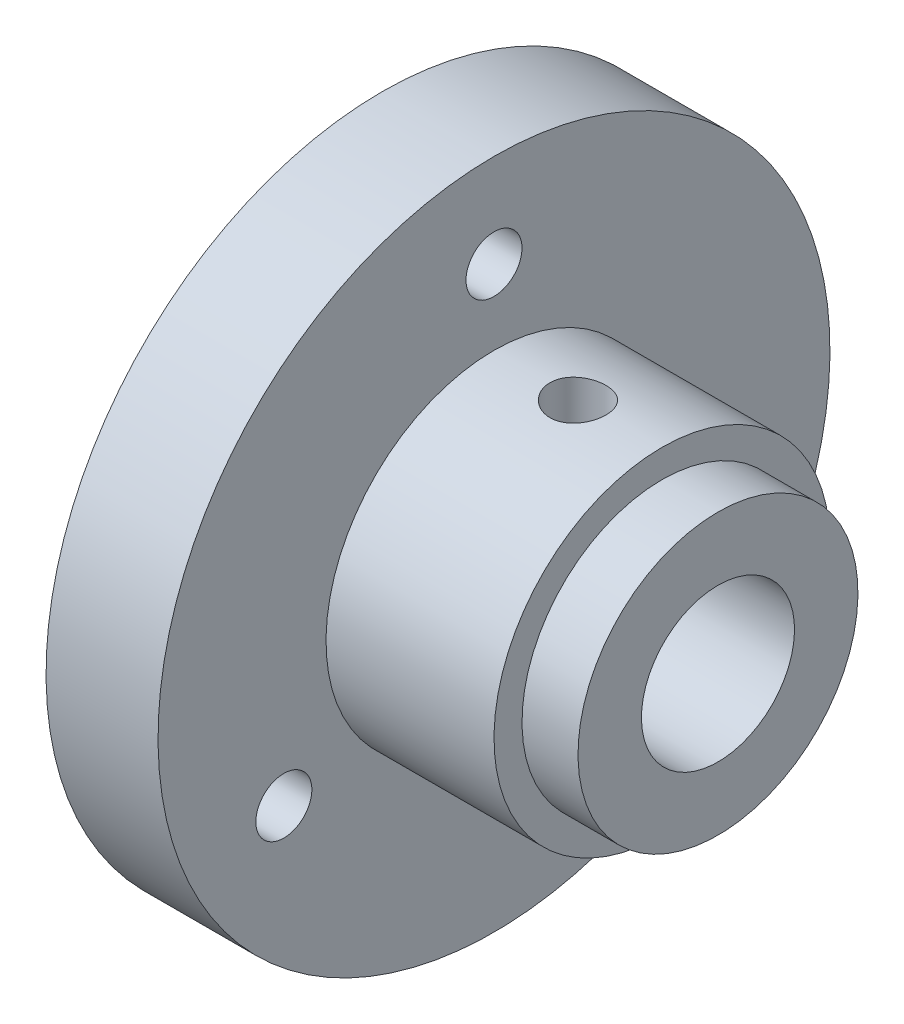
ISO-10303-21;
HEADER;
FILE_DESCRIPTION(('STEP AP214'),'2;1');
FILE_NAME('part.step','',(''),(''),'','','');
FILE_SCHEMA(('AUTOMOTIVE_DESIGN { 1 0 10303 214 1 1 1 1 }'));
ENDSEC;
DATA;
#1=APPLICATION_CONTEXT('core data for automotive mechanical design processes');
#2=APPLICATION_PROTOCOL_DEFINITION('international standard','automotive_design',2000,#1);
#3=PRODUCT_CONTEXT('',#1,'mechanical');
#4=PRODUCT('Part','Part','',(#3));
#5=PRODUCT_RELATED_PRODUCT_CATEGORY('part','',(#4));
#6=PRODUCT_DEFINITION_FORMATION('','',#4);
#7=PRODUCT_DEFINITION_CONTEXT('part definition',#1,'design');
#8=PRODUCT_DEFINITION('design','',#6,#7);
#9=PRODUCT_DEFINITION_SHAPE('','',#8);
#10=(LENGTH_UNIT() NAMED_UNIT(*) SI_UNIT(.MILLI.,.METRE.));
#11=(NAMED_UNIT(*) PLANE_ANGLE_UNIT() SI_UNIT($,.RADIAN.));
#12=(NAMED_UNIT(*) SI_UNIT($,.STERADIAN.) SOLID_ANGLE_UNIT());
#13=UNCERTAINTY_MEASURE_WITH_UNIT(LENGTH_MEASURE(1.E-05),#10,'distance_accuracy_value','');
#14=(GEOMETRIC_REPRESENTATION_CONTEXT(3) GLOBAL_UNCERTAINTY_ASSIGNED_CONTEXT((#13)) GLOBAL_UNIT_ASSIGNED_CONTEXT((#10,
#11,#12)) REPRESENTATION_CONTEXT('',''));
#15=CARTESIAN_POINT('',(0.,0.,0.));
#16=DIRECTION('',(0.,0.,1.));
#17=DIRECTION('',(1.,0.,0.));
#18=AXIS2_PLACEMENT_3D('',#15,#16,#17);
#19=CARTESIAN_POINT('',(-12.,18.,0.));
#20=DIRECTION('',(1.,0.,0.));
#21=DIRECTION('',(0.,1.,0.));
#22=AXIS2_PLACEMENT_3D('',#19,#20,#21);
#23=PLANE('',#22);
#24=CARTESIAN_POINT('',(-12.,13.,0.));
#25=DIRECTION('',(1.,0.,0.));
#26=DIRECTION('',(0.,1.,0.));
#27=AXIS2_PLACEMENT_3D('',#24,#25,#26);
#28=CIRCLE('',#27,1.5);
#29=CARTESIAN_POINT('',(-12.,14.5,0.));
#30=VERTEX_POINT('',#29);
#31=EDGE_CURVE('E80',#30,#30,#28,.T.);
#32=ORIENTED_EDGE('',*,*,#31,.F.);
#33=EDGE_LOOP('',(#32));
#34=FACE_BOUND('',#33,.T.);
#35=CARTESIAN_POINT('',(-12.,-6.5,-11.2583302491977));
#36=DIRECTION('',(1.,0.,0.));
#37=DIRECTION('',(0.,1.,0.));
#38=AXIS2_PLACEMENT_3D('',#35,#36,#37);
#39=CIRCLE('',#38,1.5);
#40=CARTESIAN_POINT('',(-12.,-5.,-11.2583302491977));
#41=VERTEX_POINT('',#40);
#42=EDGE_CURVE('E77',#41,#41,#39,.T.);
#43=ORIENTED_EDGE('',*,*,#42,.F.);
#44=EDGE_LOOP('',(#43));
#45=FACE_BOUND('',#44,.T.);
#46=CARTESIAN_POINT('',(-12.,-6.50000000000001,11.2583302491977));
#47=DIRECTION('',(1.,0.,0.));
#48=DIRECTION('',(0.,1.,0.));
#49=AXIS2_PLACEMENT_3D('',#46,#47,#48);
#50=CIRCLE('',#49,1.5);
#51=CARTESIAN_POINT('',(-12.,-5.00000000000001,11.2583302491977));
#52=VERTEX_POINT('',#51);
#53=EDGE_CURVE('E70',#52,#52,#50,.T.);
#54=ORIENTED_EDGE('',*,*,#53,.F.);
#55=EDGE_LOOP('',(#54));
#56=FACE_BOUND('',#55,.T.);
#57=CARTESIAN_POINT('',(-12.,0.,0.));
#58=DIRECTION('',(1.,0.,0.));
#59=DIRECTION('',(0.,1.,0.));
#60=AXIS2_PLACEMENT_3D('',#57,#58,#59);
#61=CIRCLE('',#60,18.);
#62=CARTESIAN_POINT('',(-12.,18.,0.));
#63=VERTEX_POINT('',#62);
#64=EDGE_CURVE('E63',#63,#63,#61,.T.);
#65=ORIENTED_EDGE('',*,*,#64,.T.);
#66=EDGE_LOOP('',(#65));
#67=FACE_BOUND('',#66,.T.);
#68=CARTESIAN_POINT('',(-12.,0.,0.));
#69=DIRECTION('',(1.,0.,0.));
#70=DIRECTION('',(0.,1.,0.));
#71=AXIS2_PLACEMENT_3D('',#68,#69,#70);
#72=CIRCLE('',#71,9.);
#73=CARTESIAN_POINT('',(-12.,9.,0.));
#74=VERTEX_POINT('',#73);
#75=EDGE_CURVE('E10',#74,#74,#72,.T.);
#76=ORIENTED_EDGE('',*,*,#75,.F.);
#77=EDGE_LOOP('',(#76));
#78=FACE_BOUND('',#77,.T.);
#79=ADVANCED_FACE('F35',(#34,#45,#56,#67,#78),#23,.T.);
#80=CARTESIAN_POINT('',(0.,0.,0.));
#81=DIRECTION('',(1.,0.,0.));
#82=DIRECTION('',(0.,1.,0.));
#83=AXIS2_PLACEMENT_3D('',#80,#81,#82);
#84=CYLINDRICAL_SURFACE('',#83,9.);
#85=CARTESIAN_POINT('',(-9.,9.,0.));
#86=CARTESIAN_POINT('',(-8.99999664663131,8.99999856701294,-0.0836345429749288));
#87=CARTESIAN_POINT('',(-8.99298163501864,8.9988220674782,-0.167314729103292));
#88=CARTESIAN_POINT('',(-8.9651186047408,8.99424206964832,-0.332328133003825));
#89=CARTESIAN_POINT('',(-8.94425786585303,8.99083652354334,-0.413659120775548));
#90=CARTESIAN_POINT('',(-8.88935073084434,8.9821804094187,-0.571562848327586));
#91=CARTESIAN_POINT('',(-8.85531512061565,8.97693135095516,-0.64813942105914));
#92=CARTESIAN_POINT('',(-8.77505262476856,8.96516536249242,-0.794485105186767));
#93=CARTESIAN_POINT('',(-8.7288271335102,8.9586485775266,-0.864254993927155));
#94=CARTESIAN_POINT('',(-8.62502694970772,8.94499990474988,-0.995683568575008));
#95=CARTESIAN_POINT('',(-8.56735853121832,8.93786323088914,-1.05726774212098));
#96=CARTESIAN_POINT('',(-8.44251121891631,8.92381576126039,-1.16993309919596));
#97=CARTESIAN_POINT('',(-8.37533172512603,8.916904979776,-1.22101361963458));
#98=CARTESIAN_POINT('',(-8.23285742028176,8.90404539455868,-1.31152027536308));
#99=CARTESIAN_POINT('',(-8.15751519791714,8.89810277454981,-1.3508727317166));
#100=CARTESIAN_POINT('',(-8.00117426141962,8.88791873876805,-1.41633501924673));
#101=CARTESIAN_POINT('',(-7.92017592979342,8.88367720808584,-1.44244574493937));
#102=CARTESIAN_POINT('',(-7.75561183508607,8.87742322105653,-1.48044862667088));
#103=CARTESIAN_POINT('',(-7.67207655809916,8.8753906109142,-1.49246941748124));
#104=CARTESIAN_POINT('',(-7.50415183386991,8.87372363361989,-1.50235003517392));
#105=CARTESIAN_POINT('',(-7.41976244749962,8.87408909674328,-1.5002108642334));
#106=CARTESIAN_POINT('',(-7.25344328323473,8.87715857318133,-1.48193705903769));
#107=CARTESIAN_POINT('',(-7.17149711787286,8.8798384399135,-1.46594692913386));
#108=CARTESIAN_POINT('',(-7.01146720930252,8.88719697126605,-1.42065188424207));
#109=CARTESIAN_POINT('',(-6.93338359866687,8.89187570443963,-1.39134651259184));
#110=CARTESIAN_POINT('',(-6.78286270593544,8.9027308760046,-1.32010634765635));
#111=CARTESIAN_POINT('',(-6.71045435635126,8.90891440264395,-1.27811154832783));
#112=CARTESIAN_POINT('',(-6.57365735967696,8.92207751049005,-1.18272721053446));
#113=CARTESIAN_POINT('',(-6.50926936052704,8.92905715592572,-1.12933675239257));
#114=CARTESIAN_POINT('',(-6.38950434851559,8.94313216727871,-1.01188932729543));
#115=CARTESIAN_POINT('',(-6.33424888887595,8.95022789538991,-0.947708378323876));
#116=CARTESIAN_POINT('',(-6.23527334240079,8.96365560838034,-0.810921149388988));
#117=CARTESIAN_POINT('',(-6.19155332989006,8.96998758833847,-0.738314815143853));
#118=CARTESIAN_POINT('',(-6.11687866371823,8.98118335735747,-0.586623549700026));
#119=CARTESIAN_POINT('',(-6.08593474840124,8.98604591044468,-0.507533235338796));
#120=CARTESIAN_POINT('',(-6.03780347085241,8.99374501807596,-0.345179007361638));
#121=CARTESIAN_POINT('',(-6.02061495781576,8.99658174210284,-0.26191544350768));
#122=CARTESIAN_POINT('',(-6.00064718492331,8.99988677905612,-0.0946259407809737));
#123=CARTESIAN_POINT('',(-5.99770105691663,9.00038251807671,-0.0106204422906061));
#124=CARTESIAN_POINT('',(-6.00585680665687,8.99902484652702,0.156683863733933));
#125=CARTESIAN_POINT('',(-6.01695814388024,8.99717152634471,0.239982698335224));
#126=CARTESIAN_POINT('',(-6.05275490960128,8.99134096162921,0.402993705328059));
#127=CARTESIAN_POINT('',(-6.07736772503407,8.98737662880787,0.482724521031228));
#128=CARTESIAN_POINT('',(-6.13940071091972,8.97776678673215,0.636928130916266));
#129=CARTESIAN_POINT('',(-6.17682160058116,8.97212118307212,0.711400629545832));
#130=CARTESIAN_POINT('',(-6.26379067481807,8.95970709781445,0.853698413681375));
#131=CARTESIAN_POINT('',(-6.31344309370035,8.95292913532213,0.921459150562289));
#132=CARTESIAN_POINT('',(-6.42332238923103,8.93903080435141,1.04774615130161));
#133=CARTESIAN_POINT('',(-6.483550033966,8.93191041102928,1.10627174381795));
#134=CARTESIAN_POINT('',(-6.61361852884285,8.91804105141507,1.2130456677948));
#135=CARTESIAN_POINT('',(-6.68355249930864,8.91129669682264,1.26118125666823));
#136=CARTESIAN_POINT('',(-6.83061178148312,8.8990291786673,1.34502138617699));
#137=CARTESIAN_POINT('',(-6.90773686513649,8.89350597639612,1.38072632086189));
#138=CARTESIAN_POINT('',(-7.06667383968727,8.88434072218623,1.43852299888389));
#139=CARTESIAN_POINT('',(-7.14846485701829,8.88069092586639,1.46067085952877));
#140=CARTESIAN_POINT('',(-7.31467207753305,8.87566630101156,1.49090127226697));
#141=CARTESIAN_POINT('',(-7.39908805183923,8.87429127469633,1.4989850471677));
#142=CARTESIAN_POINT('',(-7.56702309957744,8.87398039850407,1.50082371962841));
#143=CARTESIAN_POINT('',(-7.65054022714517,8.8750143390339,1.49475608167511));
#144=CARTESIAN_POINT('',(-7.81534754883045,8.87933868872237,1.46884790337411));
#145=CARTESIAN_POINT('',(-7.89663775016512,8.88262909056728,1.44900740766749));
#146=CARTESIAN_POINT('',(-8.05461506237556,8.89108413769031,1.39618469375694));
#147=CARTESIAN_POINT('',(-8.13130740603361,8.89624660331802,1.36321775436027));
#148=CARTESIAN_POINT('',(-8.2781014015169,8.90786621353324,1.28509620234955));
#149=CARTESIAN_POINT('',(-8.34820272622328,8.91432342233039,1.23994098524914));
#150=CARTESIAN_POINT('',(-8.48072134986465,8.92790072427373,1.13809133062329));
#151=CARTESIAN_POINT('',(-8.54303761002016,8.93502777345781,1.08126633815619));
#152=CARTESIAN_POINT('',(-8.65731096268496,8.94908623416504,0.957965418828139));
#153=CARTESIAN_POINT('',(-8.7092656611829,8.95601760015928,0.891487267747582));
#154=CARTESIAN_POINT('',(-8.80166896091996,8.96895917785332,0.750221501784169));
#155=CARTESIAN_POINT('',(-8.84203562358777,8.97496269751862,0.675379672519691));
#156=CARTESIAN_POINT('',(-8.90956169076595,8.98530700561065,0.519907841627389));
#157=CARTESIAN_POINT('',(-8.93673424864782,8.98964944906489,0.439283696898006));
#158=CARTESIAN_POINT('',(-8.971203164476,8.99523474499773,0.298621986027241));
#159=CARTESIAN_POINT('',(-8.98198468176957,8.99701216364015,0.239435298179069));
#160=CARTESIAN_POINT('',(-8.99638424270685,8.99939529591673,0.120173586191885));
#161=CARTESIAN_POINT('',(-9.00000240968241,9.00000102972385,0.0600985773650965));
#162=CARTESIAN_POINT('',(-9.,9.,0.));
#163=B_SPLINE_CURVE_WITH_KNOTS('',3,(#85,#86,#87,#88,#89,#90,#91,#92,#93,#94,#95,#96,#97,#98,
#99,#100,#101,#102,#103,#104,#105,#106,#107,#108,#109,#110,#111,#112,#113,#114,#115,#116,#117,
#118,#119,#120,#121,#122,#123,#124,#125,#126,#127,#128,#129,#130,#131,#132,#133,#134,#135,#136,
#137,#138,#139,#140,#141,#142,#143,#144,#145,#146,#147,#148,#149,#150,#151,#152,#153,#154,#155,
#156,#157,#158,#159,#160,#161,#162),.UNSPECIFIED.,.T.,.F.,(4,2,2,2,2,2,2,2,2,2,2,2,2,2,2,2,2,2,
2,2,2,2,2,2,2,2,2,2,2,2,2,2,2,2,2,2,2,2,4),(0.,0.250683950963106,0.501598527417252,
0.752308120215162,1.00298904760487,1.25581494637399,1.50865680101914,1.76305512494304,
2.01743626125709,2.26947646262054,2.52149882592532,2.77092313056245,3.02035599015229,
3.27098733979535,3.52163892408344,3.77539661946796,4.02915594981509,4.28312813349542,
4.53707906712689,4.78804730094838,5.03900587821516,5.28844684203849,5.5379018149564,
5.78956095376214,6.0412383783257,6.29552293204572,6.54979942425566,6.80301613405063,
7.05621082671971,7.3062474571362,7.5562832771288,7.80602890935734,8.05578693017602,
8.30850830516035,8.56128800327384,8.8158133896432,9.07008451278043,9.25022548898411,
9.43036336366181),.UNSPECIFIED.);
#164=CARTESIAN_POINT('',(-9.,9.,0.));
#165=VERTEX_POINT('',#164);
#166=EDGE_CURVE('E92',#165,#165,#163,.T.);
#167=ORIENTED_EDGE('',*,*,#166,.T.);
#168=EDGE_LOOP('',(#167));
#169=FACE_BOUND('',#168,.T.);
#170=ORIENTED_EDGE('',*,*,#75,.T.);
#171=EDGE_LOOP('',(#170));
#172=FACE_BOUND('',#171,.T.);
#173=CARTESIAN_POINT('',(-3.,0.,0.));
#174=DIRECTION('',(1.,0.,0.));
#175=DIRECTION('',(0.,1.,0.));
#176=AXIS2_PLACEMENT_3D('',#173,#174,#175);
#177=CIRCLE('',#176,9.);
#178=CARTESIAN_POINT('',(-3.,9.,0.));
#179=VERTEX_POINT('',#178);
#180=EDGE_CURVE('E41',#179,#179,#177,.T.);
#181=ORIENTED_EDGE('',*,*,#180,.F.);
#182=EDGE_LOOP('',(#181));
#183=FACE_BOUND('',#182,.T.);
#184=ADVANCED_FACE('F139',(#169,#172,#183),#84,.T.);
#185=CARTESIAN_POINT('',(-3.,9.,0.));
#186=DIRECTION('',(1.,0.,0.));
#187=DIRECTION('',(0.,1.,0.));
#188=AXIS2_PLACEMENT_3D('',#185,#186,#187);
#189=PLANE('',#188);
#190=ORIENTED_EDGE('',*,*,#180,.T.);
#191=EDGE_LOOP('',(#190));
#192=FACE_BOUND('',#191,.T.);
#193=CARTESIAN_POINT('',(-3.,0.,0.));
#194=DIRECTION('',(1.,0.,0.));
#195=DIRECTION('',(0.,1.,0.));
#196=AXIS2_PLACEMENT_3D('',#193,#194,#195);
#197=CIRCLE('',#196,7.5);
#198=CARTESIAN_POINT('',(-3.,7.5,0.));
#199=VERTEX_POINT('',#198);
#200=EDGE_CURVE('E45',#199,#199,#197,.T.);
#201=ORIENTED_EDGE('',*,*,#200,.F.);
#202=EDGE_LOOP('',(#201));
#203=FACE_BOUND('',#202,.T.);
#204=ADVANCED_FACE('F136',(#192,#203),#189,.T.);
#205=CARTESIAN_POINT('',(0.,0.,0.));
#206=DIRECTION('',(1.,0.,0.));
#207=DIRECTION('',(0.,1.,0.));
#208=AXIS2_PLACEMENT_3D('',#205,#206,#207);
#209=CYLINDRICAL_SURFACE('',#208,7.5);
#210=ORIENTED_EDGE('',*,*,#200,.T.);
#211=EDGE_LOOP('',(#210));
#212=FACE_BOUND('',#211,.T.);
#213=CARTESIAN_POINT('',(0.,0.,0.));
#214=DIRECTION('',(1.,0.,0.));
#215=DIRECTION('',(0.,1.,0.));
#216=AXIS2_PLACEMENT_3D('',#213,#214,#215);
#217=CIRCLE('',#216,7.5);
#218=CARTESIAN_POINT('',(0.,7.5,0.));
#219=VERTEX_POINT('',#218);
#220=EDGE_CURVE('E49',#219,#219,#217,.T.);
#221=ORIENTED_EDGE('',*,*,#220,.F.);
#222=EDGE_LOOP('',(#221));
#223=FACE_BOUND('',#222,.T.);
#224=ADVANCED_FACE('F132',(#212,#223),#209,.T.);
#225=CARTESIAN_POINT('',(0.,4.1,0.));
#226=DIRECTION('',(1.,0.,0.));
#227=DIRECTION('',(0.,1.,0.));
#228=AXIS2_PLACEMENT_3D('',#225,#226,#227);
#229=PLANE('',#228);
#230=ORIENTED_EDGE('',*,*,#220,.T.);
#231=EDGE_LOOP('',(#230));
#232=FACE_BOUND('',#231,.T.);
#233=CARTESIAN_POINT('',(0.,0.,0.));
#234=DIRECTION('',(1.,0.,0.));
#235=DIRECTION('',(0.,1.,0.));
#236=AXIS2_PLACEMENT_3D('',#233,#234,#235);
#237=CIRCLE('',#236,4.1);
#238=CARTESIAN_POINT('',(0.,4.1,0.));
#239=VERTEX_POINT('',#238);
#240=EDGE_CURVE('E54',#239,#239,#237,.T.);
#241=ORIENTED_EDGE('',*,*,#240,.F.);
#242=EDGE_LOOP('',(#241));
#243=FACE_BOUND('',#242,.T.);
#244=ADVANCED_FACE('F128',(#232,#243),#229,.T.);
#245=CARTESIAN_POINT('',(0.,0.,0.));
#246=DIRECTION('',(1.,0.,0.));
#247=DIRECTION('',(0.,1.,0.));
#248=AXIS2_PLACEMENT_3D('',#245,#246,#247);
#249=CYLINDRICAL_SURFACE('',#248,4.1);
#250=CARTESIAN_POINT('',(-9.,4.1,0.));
#251=CARTESIAN_POINT('',(-9.00000225760715,4.10000165923337,0.0813740986922776));
#252=CARTESIAN_POINT('',(-8.99335733828631,4.09755603188339,0.162732381393539));
#253=CARTESIAN_POINT('',(-8.96705471752054,4.0880434904737,0.323025233172477));
#254=CARTESIAN_POINT('',(-8.94739818730522,4.08097699235862,0.401960019730075));
#255=CARTESIAN_POINT('',(-8.89585535434763,4.0629833885131,0.555071487889497));
#256=CARTESIAN_POINT('',(-8.86399193843784,4.05206351053414,0.629256772409256));
#257=CARTESIAN_POINT('',(-8.78905328125515,4.02745683042766,0.771225667429234));
#258=CARTESIAN_POINT('',(-8.74597519288033,4.01376932587196,0.839007646339359));
#259=CARTESIAN_POINT('',(-8.64799554564769,3.9844238013988,0.96900582909011));
#260=CARTESIAN_POINT('',(-8.59271802998933,3.96871189278822,1.03092640488845));
#261=CARTESIAN_POINT('',(-8.47270690311465,3.93736046691879,1.14485387979851));
#262=CARTESIAN_POINT('',(-8.40797060574449,3.9217209715302,1.196857953068));
#263=CARTESIAN_POINT('',(-8.26804336393156,3.89166611039283,1.29131121165982));
#264=CARTESIAN_POINT('',(-8.19256058268585,3.87731482612409,1.33335047267299));
#265=CARTESIAN_POINT('',(-8.03498771496107,3.85229543692908,1.40400686283184));
#266=CARTESIAN_POINT('',(-7.95290013678358,3.84162594183641,1.43262905944607));
#267=CARTESIAN_POINT('',(-7.78784309714416,3.82575230014126,1.47448484912168));
#268=CARTESIAN_POINT('',(-7.7050359164745,3.82034931558201,1.48828050899189));
#269=CARTESIAN_POINT('',(-7.53811924551098,3.81503701544761,1.50184918247519));
#270=CARTESIAN_POINT('',(-7.45401027297593,3.8151255691561,1.50162763476286));
#271=CARTESIAN_POINT('',(-7.29193635812895,3.82061424907924,1.48759945441916));
#272=CARTESIAN_POINT('',(-7.21389285468416,3.8257138626067,1.47456140896715));
#273=CARTESIAN_POINT('',(-7.06118956125272,3.84015239752295,1.43653709451533));
#274=CARTESIAN_POINT('',(-6.98653025772051,3.84949192625715,1.41154911372317));
#275=CARTESIAN_POINT('',(-6.84110766092397,3.87154626954868,1.34989422199145));
#276=CARTESIAN_POINT('',(-6.77044087065887,3.88431981714444,1.31302162475225));
#277=CARTESIAN_POINT('',(-6.63607014520467,3.91178223049179,1.22878734925743));
#278=CARTESIAN_POINT('',(-6.57236854096865,3.92647173384818,1.18142217552962));
#279=CARTESIAN_POINT('',(-6.44946662025197,3.95725340619187,1.07399109681739));
#280=CARTESIAN_POINT('',(-6.39081180984511,3.97337530864785,1.01330819384257));
#281=CARTESIAN_POINT('',(-6.28435345068309,4.00439734819749,0.882778152896212));
#282=CARTESIAN_POINT('',(-6.23655141276451,4.01929731499878,0.812929741108656));
#283=CARTESIAN_POINT('',(-6.15259238243992,4.04646797369406,0.664714054152152));
#284=CARTESIAN_POINT('',(-6.116608884271,4.05869867852746,0.586240652637122));
#285=CARTESIAN_POINT('',(-6.05853261541413,4.07885780692981,0.423796207871716));
#286=CARTESIAN_POINT('',(-6.03643398473199,4.08678804528155,0.339827500413559));
#287=CARTESIAN_POINT('',(-6.00778451852227,4.09713788657497,0.173373324809644));
#288=CARTESIAN_POINT('',(-6.00049855343125,4.09981778885173,0.0910304386273678));
#289=CARTESIAN_POINT('',(-5.99955130218481,4.10016397145853,-0.0737349888057339));
#290=CARTESIAN_POINT('',(-6.00588716652387,4.09783130035231,-0.156157509792853));
#291=CARTESIAN_POINT('',(-6.0314392411991,4.08858637067619,-0.315619682076168));
#292=CARTESIAN_POINT('',(-6.05018085162095,4.08184296018592,-0.392746182232297));
#293=CARTESIAN_POINT('',(-6.09939476774774,4.06462370646837,-0.542711380140934));
#294=CARTESIAN_POINT('',(-6.12986859964159,4.05414737765672,-0.615549518619011));
#295=CARTESIAN_POINT('',(-6.20263978551781,4.03012814449962,-0.757219099885719));
#296=CARTESIAN_POINT('',(-6.24525249453868,4.01650558442052,-0.825874642238022));
#297=CARTESIAN_POINT('',(-6.3407324607531,3.98771009471685,-0.955285476107552));
#298=CARTESIAN_POINT('',(-6.39360336961909,3.97253661391466,-1.01603794141656));
#299=CARTESIAN_POINT('',(-6.51153499626531,3.94127640449602,-1.13141965879987));
#300=CARTESIAN_POINT('',(-6.57710725549713,3.92518547050206,-1.18552627116467));
#301=CARTESIAN_POINT('',(-6.71672556239296,3.8947254276213,-1.28206233851266));
#302=CARTESIAN_POINT('',(-6.79077218229118,3.88035643514349,-1.32449100427889));
#303=CARTESIAN_POINT('',(-6.94569559634257,3.85505006352086,-1.39644382600855));
#304=CARTESIAN_POINT('',(-7.02658889549248,3.84412129484959,-1.42593567403877));
#305=CARTESIAN_POINT('',(-7.19270108637262,3.82722201049798,-1.47069890392734));
#306=CARTESIAN_POINT('',(-7.27791744602936,3.8212486271643,-1.48597851095032));
#307=CARTESIAN_POINT('',(-7.44462468945327,3.81530529129036,-1.50116808969002));
#308=CARTESIAN_POINT('',(-7.52602326416062,3.81498941101176,-1.50196373488399));
#309=CARTESIAN_POINT('',(-7.68772832749472,3.819517104986,-1.4904116187976));
#310=CARTESIAN_POINT('',(-7.76803490910807,3.82436023711105,-1.47806498381182));
#311=CARTESIAN_POINT('',(-7.92303247375525,3.83837884223993,-1.44125524124318));
#312=CARTESIAN_POINT('',(-7.99781731374051,3.84743089438031,-1.41713639573516));
#313=CARTESIAN_POINT('',(-8.14232656909407,3.86878113434589,-1.35776394991054));
#314=CARTESIAN_POINT('',(-8.21204973054306,3.88108012305306,-1.32250760202065));
#315=CARTESIAN_POINT('',(-8.34828553689679,3.90831232622282,-1.23979005983385));
#316=CARTESIAN_POINT('',(-8.41445773618904,3.92334727183663,-1.19180200941116));
#317=CARTESIAN_POINT('',(-8.53809398930622,3.95399099920457,-1.08581555321808));
#318=CARTESIAN_POINT('',(-8.59555533408883,3.96959995760681,-1.02781404524661));
#319=CARTESIAN_POINT('',(-8.70309003506571,4.00057969291034,-0.89994268034983));
#320=CARTESIAN_POINT('',(-8.75264383914761,4.01589864619417,-0.829621427559435));
#321=CARTESIAN_POINT('',(-8.83920330787209,4.04373358074725,-0.681116261966704));
#322=CARTESIAN_POINT('',(-8.87620900904226,4.05624957017589,-0.602932372053397));
#323=CARTESIAN_POINT('',(-8.93705267749104,4.0772884441959,-0.438970884453415));
#324=CARTESIAN_POINT('',(-8.96056810516217,4.08571283393727,-0.353059962353392));
#325=CARTESIAN_POINT('',(-8.99203709735274,4.0970664915302,-0.178092111155029));
#326=CARTESIAN_POINT('',(-8.99999752980811,4.09999818452701,-0.0890365881704461));
#327=CARTESIAN_POINT('',(-9.,4.1,0.));
#328=B_SPLINE_CURVE_WITH_KNOTS('',3,(#250,#251,#252,#253,#254,#255,#256,#257,#258,#259,#260,
#261,#262,#263,#264,#265,#266,#267,#268,#269,#270,#271,#272,#273,#274,#275,#276,#277,#278,#279,
#280,#281,#282,#283,#284,#285,#286,#287,#288,#289,#290,#291,#292,#293,#294,#295,#296,#297,#298,
#299,#300,#301,#302,#303,#304,#305,#306,#307,#308,#309,#310,#311,#312,#313,#314,#315,#316,#317,
#318,#319,#320,#321,#322,#323,#324,#325,#326,#327),.UNSPECIFIED.,.T.,.F.,(4,2,2,2,2,2,2,2,2,2,2,
2,2,2,2,2,2,2,2,2,2,2,2,2,2,2,2,2,2,2,2,2,2,2,2,2,2,2,4),(0.,0.243794049083335,
0.487566156226918,0.730883431502573,0.974262538792077,1.22657525763996,1.4789597693305,
1.74040261461265,2.00174663626736,2.25278996657886,2.50373589271099,2.74049742501652,
2.97729288286409,3.21842895973516,3.45964548923986,3.71623310666607,3.97285642230447,
4.23309408884832,4.49322185031936,4.74008954228773,4.9869055978436,5.22478638264147,
5.46269812268128,5.70746441042718,5.95231798947644,6.21067838421004,6.46905623512597,
6.72807572592058,6.9869452188387,7.22992815591336,7.47289027100512,7.70913823600103,
7.94544452791357,8.19369587790558,8.44202427542417,8.7028917113523,8.96375838788768,
9.23062685247368,9.49737746102695),.UNSPECIFIED.);
#329=CARTESIAN_POINT('',(-9.,4.1,0.));
#330=VERTEX_POINT('',#329);
#331=EDGE_CURVE('E71',#330,#330,#328,.T.);
#332=ORIENTED_EDGE('',*,*,#331,.T.);
#333=EDGE_LOOP('',(#332));
#334=FACE_BOUND('',#333,.T.);
#335=ORIENTED_EDGE('',*,*,#240,.T.);
#336=EDGE_LOOP('',(#335));
#337=FACE_BOUND('',#336,.T.);
#338=CARTESIAN_POINT('',(-18.,0.,0.));
#339=DIRECTION('',(1.,0.,0.));
#340=DIRECTION('',(0.,1.,0.));
#341=AXIS2_PLACEMENT_3D('',#338,#339,#340);
#342=CIRCLE('',#341,4.1);
#343=CARTESIAN_POINT('',(-18.,4.1,0.));
#344=VERTEX_POINT('',#343);
#345=EDGE_CURVE('E57',#344,#344,#342,.T.);
#346=ORIENTED_EDGE('',*,*,#345,.F.);
#347=EDGE_LOOP('',(#346));
#348=FACE_BOUND('',#347,.T.);
#349=ADVANCED_FACE('F124',(#334,#337,#348),#249,.F.);
#350=CARTESIAN_POINT('',(-18.,4.1,0.));
#351=DIRECTION('',(-1.,0.,0.));
#352=DIRECTION('',(0.,-1.,0.));
#353=AXIS2_PLACEMENT_3D('',#350,#351,#352);
#354=PLANE('',#353);
#355=CARTESIAN_POINT('',(-18.,13.,0.));
#356=DIRECTION('',(1.,0.,0.));
#357=DIRECTION('',(0.,1.,0.));
#358=AXIS2_PLACEMENT_3D('',#355,#356,#357);
#359=CIRCLE('',#358,1.5);
#360=CARTESIAN_POINT('',(-18.,14.5,0.));
#361=VERTEX_POINT('',#360);
#362=EDGE_CURVE('E66',#361,#361,#359,.T.);
#363=ORIENTED_EDGE('',*,*,#362,.T.);
#364=EDGE_LOOP('',(#363));
#365=FACE_BOUND('',#364,.T.);
#366=CARTESIAN_POINT('',(-18.,-6.5,-11.2583302491977));
#367=DIRECTION('',(1.,0.,0.));
#368=DIRECTION('',(0.,1.,0.));
#369=AXIS2_PLACEMENT_3D('',#366,#367,#368);
#370=CIRCLE('',#369,1.5);
#371=CARTESIAN_POINT('',(-18.,-5.,-11.2583302491977));
#372=VERTEX_POINT('',#371);
#373=EDGE_CURVE('E74',#372,#372,#370,.T.);
#374=ORIENTED_EDGE('',*,*,#373,.T.);
#375=EDGE_LOOP('',(#374));
#376=FACE_BOUND('',#375,.T.);
#377=CARTESIAN_POINT('',(-18.,-6.50000000000001,11.2583302491977));
#378=DIRECTION('',(1.,0.,0.));
#379=DIRECTION('',(0.,1.,0.));
#380=AXIS2_PLACEMENT_3D('',#377,#378,#379);
#381=CIRCLE('',#380,1.5);
#382=CARTESIAN_POINT('',(-18.,-5.00000000000001,11.2583302491977));
#383=VERTEX_POINT('',#382);
#384=EDGE_CURVE('E67',#383,#383,#381,.T.);
#385=ORIENTED_EDGE('',*,*,#384,.T.);
#386=EDGE_LOOP('',(#385));
#387=FACE_BOUND('',#386,.T.);
#388=ORIENTED_EDGE('',*,*,#345,.T.);
#389=EDGE_LOOP('',(#388));
#390=FACE_BOUND('',#389,.T.);
#391=CARTESIAN_POINT('',(-18.,0.,0.));
#392=DIRECTION('',(1.,0.,0.));
#393=DIRECTION('',(0.,1.,0.));
#394=AXIS2_PLACEMENT_3D('',#391,#392,#393);
#395=CIRCLE('',#394,18.);
#396=CARTESIAN_POINT('',(-18.,18.,0.));
#397=VERTEX_POINT('',#396);
#398=EDGE_CURVE('E60',#397,#397,#395,.T.);
#399=ORIENTED_EDGE('',*,*,#398,.F.);
#400=EDGE_LOOP('',(#399));
#401=FACE_BOUND('',#400,.T.);
#402=ADVANCED_FACE('F120',(#365,#376,#387,#390,#401),#354,.T.);
#403=CARTESIAN_POINT('',(0.,0.,0.));
#404=DIRECTION('',(1.,0.,0.));
#405=DIRECTION('',(0.,1.,0.));
#406=AXIS2_PLACEMENT_3D('',#403,#404,#405);
#407=CYLINDRICAL_SURFACE('',#406,18.);
#408=ORIENTED_EDGE('',*,*,#398,.T.);
#409=EDGE_LOOP('',(#408));
#410=FACE_BOUND('',#409,.T.);
#411=ORIENTED_EDGE('',*,*,#64,.F.);
#412=EDGE_LOOP('',(#411));
#413=FACE_BOUND('',#412,.T.);
#414=ADVANCED_FACE('F116',(#410,#413),#407,.T.);
#415=CARTESIAN_POINT('',(-18.,-6.50000000000001,11.2583302491977));
#416=DIRECTION('',(1.,0.,0.));
#417=DIRECTION('',(0.,1.,0.));
#418=AXIS2_PLACEMENT_3D('',#415,#416,#417);
#419=CYLINDRICAL_SURFACE('',#418,1.5);
#420=ORIENTED_EDGE('',*,*,#384,.F.);
#421=EDGE_LOOP('',(#420));
#422=FACE_BOUND('',#421,.T.);
#423=ORIENTED_EDGE('',*,*,#53,.T.);
#424=EDGE_LOOP('',(#423));
#425=FACE_BOUND('',#424,.T.);
#426=ADVANCED_FACE('F112',(#422,#425),#419,.F.);
#427=CARTESIAN_POINT('',(-18.,-6.5,-11.2583302491977));
#428=DIRECTION('',(1.,0.,0.));
#429=DIRECTION('',(0.,1.,0.));
#430=AXIS2_PLACEMENT_3D('',#427,#428,#429);
#431=CYLINDRICAL_SURFACE('',#430,1.5);
#432=ORIENTED_EDGE('',*,*,#373,.F.);
#433=EDGE_LOOP('',(#432));
#434=FACE_BOUND('',#433,.T.);
#435=ORIENTED_EDGE('',*,*,#42,.T.);
#436=EDGE_LOOP('',(#435));
#437=FACE_BOUND('',#436,.T.);
#438=ADVANCED_FACE('F108',(#434,#437),#431,.F.);
#439=CARTESIAN_POINT('',(-18.,13.,0.));
#440=DIRECTION('',(1.,0.,0.));
#441=DIRECTION('',(0.,1.,0.));
#442=AXIS2_PLACEMENT_3D('',#439,#440,#441);
#443=CYLINDRICAL_SURFACE('',#442,1.5);
#444=ORIENTED_EDGE('',*,*,#362,.F.);
#445=EDGE_LOOP('',(#444));
#446=FACE_BOUND('',#445,.T.);
#447=ORIENTED_EDGE('',*,*,#31,.T.);
#448=EDGE_LOOP('',(#447));
#449=FACE_BOUND('',#448,.T.);
#450=ADVANCED_FACE('F103',(#446,#449),#443,.F.);
#451=CARTESIAN_POINT('',(-7.49999999999999,-18.001,0.));
#452=DIRECTION('',(0.,1.,0.));
#453=DIRECTION('',(-1.,0.,0.));
#454=AXIS2_PLACEMENT_3D('',#451,#452,#453);
#455=CYLINDRICAL_SURFACE('',#454,1.5);
#456=ORIENTED_EDGE('',*,*,#331,.F.);
#457=EDGE_LOOP('',(#456));
#458=FACE_BOUND('',#457,.T.);
#459=ORIENTED_EDGE('',*,*,#166,.F.);
#460=EDGE_LOOP('',(#459));
#461=FACE_BOUND('',#460,.T.);
#462=ADVANCED_FACE('F97',(#458,#461),#455,.F.);
#463=CLOSED_SHELL('',(#79,#184,#204,#224,#244,#349,#402,#414,#426,#438,#450,#462));
#464=MANIFOLD_SOLID_BREP('B2',#463);
#465=ADVANCED_BREP_SHAPE_REPRESENTATION('',(#18,#464),#14);
#466=SHAPE_DEFINITION_REPRESENTATION(#9,#465);
ENDSEC;
END-ISO-10303-21;
